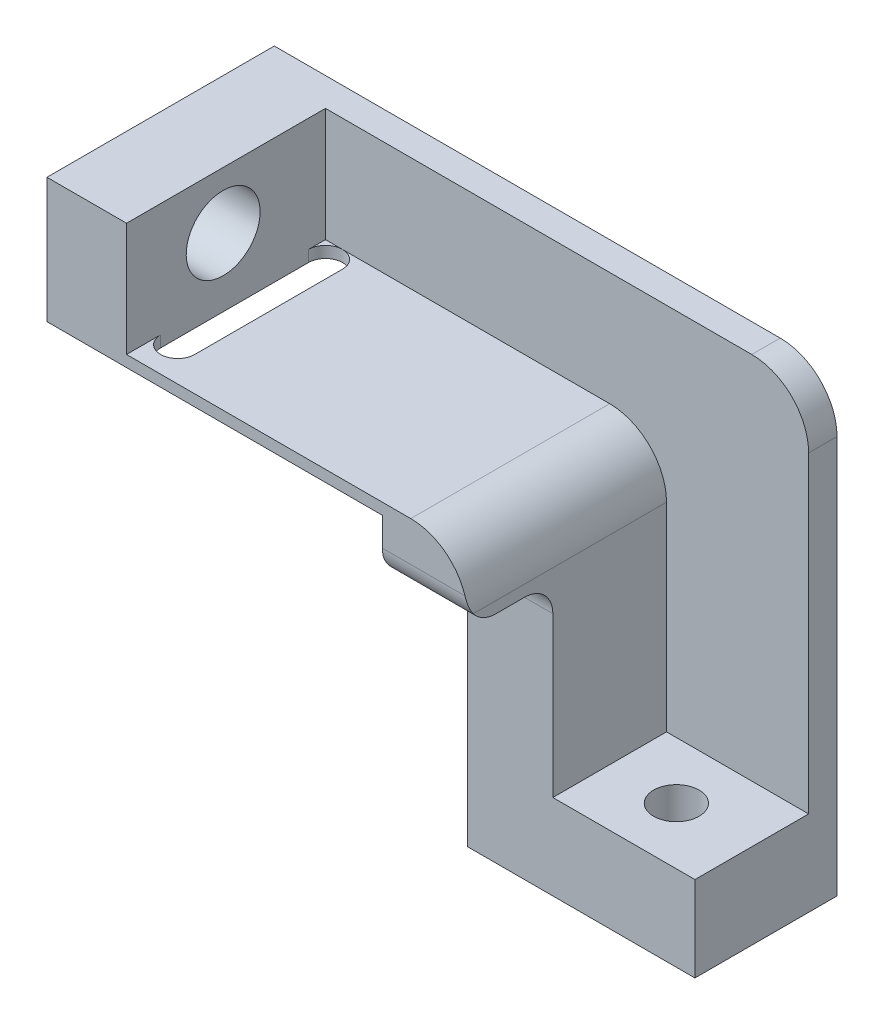
ISO-10303-21;
HEADER;
FILE_DESCRIPTION(('STEP AP214'),'2;1');
FILE_NAME('part.step','',(''),(''),'','','');
FILE_SCHEMA(('AUTOMOTIVE_DESIGN { 1 0 10303 214 1 1 1 1 }'));
ENDSEC;
DATA;
#1=APPLICATION_CONTEXT('core data for automotive mechanical design processes');
#2=APPLICATION_PROTOCOL_DEFINITION('international standard','automotive_design',2000,#1);
#3=PRODUCT_CONTEXT('',#1,'mechanical');
#4=PRODUCT('Part','Part','',(#3));
#5=PRODUCT_RELATED_PRODUCT_CATEGORY('part','',(#4));
#6=PRODUCT_DEFINITION_FORMATION('','',#4);
#7=PRODUCT_DEFINITION_CONTEXT('part definition',#1,'design');
#8=PRODUCT_DEFINITION('design','',#6,#7);
#9=PRODUCT_DEFINITION_SHAPE('','',#8);
#10=(LENGTH_UNIT() NAMED_UNIT(*) SI_UNIT(.MILLI.,.METRE.));
#11=(NAMED_UNIT(*) PLANE_ANGLE_UNIT() SI_UNIT($,.RADIAN.));
#12=(NAMED_UNIT(*) SI_UNIT($,.STERADIAN.) SOLID_ANGLE_UNIT());
#13=UNCERTAINTY_MEASURE_WITH_UNIT(LENGTH_MEASURE(1.E-05),#10,'distance_accuracy_value','');
#14=(GEOMETRIC_REPRESENTATION_CONTEXT(3) GLOBAL_UNCERTAINTY_ASSIGNED_CONTEXT((#13)) GLOBAL_UNIT_ASSIGNED_CONTEXT((#10,
#11,#12)) REPRESENTATION_CONTEXT('',''));
#15=CARTESIAN_POINT('',(0.,0.,0.));
#16=DIRECTION('',(0.,0.,1.));
#17=DIRECTION('',(1.,0.,0.));
#18=AXIS2_PLACEMENT_3D('',#15,#16,#17);
#19=CARTESIAN_POINT('',(15.,-8.32542828594916,40.));
#20=DIRECTION('',(0.,-1.,0.));
#21=DIRECTION('',(0.,0.,-1.));
#22=AXIS2_PLACEMENT_3D('',#19,#20,#21);
#23=PLANE('',#22);
#24=CARTESIAN_POINT('',(26.7301502835799,-8.32542828594916,15.));
#25=DIRECTION('',(0.,1.,0.));
#26=DIRECTION('',(0.,0.,1.));
#27=AXIS2_PLACEMENT_3D('',#24,#25,#26);
#28=CIRCLE('',#27,4.);
#29=CARTESIAN_POINT('',(26.7301502835799,-8.32542828594916,19.));
#30=VERTEX_POINT('',#29);
#31=EDGE_CURVE('E243',#30,#30,#28,.T.);
#32=ORIENTED_EDGE('',*,*,#31,.F.);
#33=EDGE_LOOP('',(#32));
#34=FACE_BOUND('',#33,.T.);
#35=DIRECTION('',(-1.,0.,0.));
#36=VECTOR('',#35,1.);
#37=CARTESIAN_POINT('',(15.,-8.32542828594916,25.));
#38=LINE('',#37,#36);
#39=CARTESIAN_POINT('',(40.,-8.32542828594916,25.));
#40=VERTEX_POINT('',#39);
#41=CARTESIAN_POINT('',(15.,-8.32542828594916,25.));
#42=VERTEX_POINT('',#41);
#43=EDGE_CURVE('E416',#40,#42,#38,.T.);
#44=ORIENTED_EDGE('',*,*,#43,.F.);
#45=DIRECTION('',(0.,0.,-1.));
#46=VECTOR('',#45,1.);
#47=CARTESIAN_POINT('',(40.,-8.32542828594916,40.));
#48=LINE('',#47,#46);
#49=CARTESIAN_POINT('',(40.,-8.32542828594915,4.99999999999999));
#50=VERTEX_POINT('',#49);
#51=EDGE_CURVE('E234',#40,#50,#48,.T.);
#52=ORIENTED_EDGE('',*,*,#51,.T.);
#53=DIRECTION('',(-1.,0.,0.));
#54=VECTOR('',#53,1.);
#55=CARTESIAN_POINT('',(40.,-8.32542828594915,4.99999999999999));
#56=LINE('',#55,#54);
#57=CARTESIAN_POINT('',(15.,-8.32542828594915,4.99999999999999));
#58=VERTEX_POINT('',#57);
#59=EDGE_CURVE('E466',#50,#58,#56,.T.);
#60=ORIENTED_EDGE('',*,*,#59,.T.);
#61=DIRECTION('',(0.,0.,-1.));
#62=VECTOR('',#61,1.);
#63=CARTESIAN_POINT('',(15.,-8.32542828594916,40.));
#64=LINE('',#63,#62);
#65=EDGE_CURVE('E231',#42,#58,#64,.T.);
#66=ORIENTED_EDGE('',*,*,#65,.F.);
#67=EDGE_LOOP('',(#44,#52,#60,#66));
#68=FACE_BOUND('',#67,.T.);
#69=ADVANCED_FACE('F39',(#34,#68),#23,.F.);
#70=CARTESIAN_POINT('',(40.,-8.32542828594916,40.));
#71=DIRECTION('',(-1.,0.,0.));
#72=DIRECTION('',(0.,-1.,0.));
#73=AXIS2_PLACEMENT_3D('',#70,#71,#72);
#74=PLANE('',#73);
#75=DIRECTION('',(0.,1.,0.));
#76=VECTOR('',#75,1.);
#77=CARTESIAN_POINT('',(40.,-23.3254282859492,25.));
#78=LINE('',#77,#76);
#79=CARTESIAN_POINT('',(40.,-23.3254282859492,25.));
#80=VERTEX_POINT('',#79);
#81=EDGE_CURVE('E196',#80,#40,#78,.T.);
#82=ORIENTED_EDGE('',*,*,#81,.F.);
#83=DIRECTION('',(0.,0.,-1.));
#84=VECTOR('',#83,1.);
#85=CARTESIAN_POINT('',(40.,-23.3254282859492,40.));
#86=LINE('',#85,#84);
#87=CARTESIAN_POINT('',(40.,-23.3254282859492,0.));
#88=VERTEX_POINT('',#87);
#89=EDGE_CURVE('E204',#80,#88,#86,.T.);
#90=ORIENTED_EDGE('',*,*,#89,.T.);
#91=DIRECTION('',(0.,1.,0.));
#92=VECTOR('',#91,1.);
#93=CARTESIAN_POINT('',(40.,-8.32542828594916,0.));
#94=LINE('',#93,#92);
#95=CARTESIAN_POINT('',(40.,46.6745717140508,0.));
#96=VERTEX_POINT('',#95);
#97=EDGE_CURVE('E242',#88,#96,#94,.T.);
#98=ORIENTED_EDGE('',*,*,#97,.T.);
#99=DIRECTION('',(0.,0.,1.));
#100=VECTOR('',#99,1.);
#101=CARTESIAN_POINT('',(40.,46.6745717140508,40.));
#102=LINE('',#101,#100);
#103=CARTESIAN_POINT('',(40.,46.6745717140508,5.));
#104=VERTEX_POINT('',#103);
#105=EDGE_CURVE('E267',#96,#104,#102,.T.);
#106=ORIENTED_EDGE('',*,*,#105,.T.);
#107=DIRECTION('',(0.,-1.,0.));
#108=VECTOR('',#107,1.);
#109=CARTESIAN_POINT('',(40.,56.6745717140508,5.));
#110=LINE('',#109,#108);
#111=EDGE_CURVE('E462',#104,#50,#110,.T.);
#112=ORIENTED_EDGE('',*,*,#111,.T.);
#113=ORIENTED_EDGE('',*,*,#51,.F.);
#114=EDGE_LOOP('',(#82,#90,#98,#106,#112,#113));
#115=FACE_BOUND('',#114,.T.);
#116=ADVANCED_FACE('F318',(#115),#74,.F.);
#117=CARTESIAN_POINT('',(40.,-23.3254282859492,40.));
#118=DIRECTION('',(0.,1.,0.));
#119=DIRECTION('',(-1.,0.,0.));
#120=AXIS2_PLACEMENT_3D('',#117,#118,#119);
#121=PLANE('',#120);
#122=CARTESIAN_POINT('',(26.7301502835799,-23.3254282859492,15.));
#123=DIRECTION('',(0.,1.,0.));
#124=DIRECTION('',(-1.,0.,0.));
#125=AXIS2_PLACEMENT_3D('',#122,#123,#124);
#126=CIRCLE('',#125,4.);
#127=CARTESIAN_POINT('',(22.7301502835799,-23.3254282859492,15.));
#128=VERTEX_POINT('',#127);
#129=EDGE_CURVE('E238',#128,#128,#126,.T.);
#130=ORIENTED_EDGE('',*,*,#129,.T.);
#131=EDGE_LOOP('',(#130));
#132=FACE_BOUND('',#131,.T.);
#133=DIRECTION('',(1.,0.,0.));
#134=VECTOR('',#133,1.);
#135=CARTESIAN_POINT('',(40.,-23.3254282859492,25.));
#136=LINE('',#135,#134);
#137=CARTESIAN_POINT('',(0.,-23.3254282859492,25.));
#138=VERTEX_POINT('',#137);
#139=EDGE_CURVE('E190',#138,#80,#136,.T.);
#140=ORIENTED_EDGE('',*,*,#139,.F.);
#141=DIRECTION('',(0.,0.,-1.));
#142=VECTOR('',#141,1.);
#143=CARTESIAN_POINT('',(0.,-23.3254282859492,40.));
#144=LINE('',#143,#142);
#145=CARTESIAN_POINT('',(0.,-23.3254282859492,0.));
#146=VERTEX_POINT('',#145);
#147=EDGE_CURVE('E202',#138,#146,#144,.T.);
#148=ORIENTED_EDGE('',*,*,#147,.T.);
#149=DIRECTION('',(1.,0.,0.));
#150=VECTOR('',#149,1.);
#151=CARTESIAN_POINT('',(40.,-23.3254282859492,0.));
#152=LINE('',#151,#150);
#153=EDGE_CURVE('E508',#146,#88,#152,.T.);
#154=ORIENTED_EDGE('',*,*,#153,.T.);
#155=ORIENTED_EDGE('',*,*,#89,.F.);
#156=EDGE_LOOP('',(#140,#148,#154,#155));
#157=FACE_BOUND('',#156,.T.);
#158=ADVANCED_FACE('F200',(#132,#157),#121,.F.);
#159=CARTESIAN_POINT('',(-45.,36.6745717140508,40.));
#160=DIRECTION('',(0.,-1.,0.));
#161=DIRECTION('',(1.,0.,0.));
#162=AXIS2_PLACEMENT_3D('',#159,#160,#161);
#163=PLANE('',#162);
#164=DIRECTION('',(0.,0.,-1.));
#165=VECTOR('',#164,1.);
#166=CARTESIAN_POINT('',(-45.,36.6745717140508,40.));
#167=LINE('',#166,#165);
#168=CARTESIAN_POINT('',(-45.,36.6745717140508,8.));
#169=VERTEX_POINT('',#168);
#170=CARTESIAN_POINT('',(-45.,36.6745717140508,5.));
#171=VERTEX_POINT('',#170);
#172=EDGE_CURVE('E477',#169,#171,#167,.T.);
#173=ORIENTED_EDGE('',*,*,#172,.F.);
#174=CARTESIAN_POINT('',(-42.,36.6745717140508,8.));
#175=DIRECTION('',(0.,-1.,0.));
#176=DIRECTION('',(1.,0.,0.));
#177=AXIS2_PLACEMENT_3D('',#174,#175,#176);
#178=CIRCLE('',#177,2.99999999999998);
#179=CARTESIAN_POINT('',(-42.,36.6745717140508,5.00000000000002));
#180=VERTEX_POINT('',#179);
#181=EDGE_CURVE('E237',#169,#180,#178,.T.);
#182=ORIENTED_EDGE('',*,*,#181,.T.);
#183=DIRECTION('',(1.,0.,0.));
#184=VECTOR('',#183,1.);
#185=CARTESIAN_POINT('',(-45.,36.6745717140508,5.));
#186=LINE('',#185,#184);
#187=EDGE_CURVE('E493',#171,#180,#186,.T.);
#188=ORIENTED_EDGE('',*,*,#187,.F.);
#189=EDGE_LOOP('',(#173,#182,#188));
#190=FACE_BOUND('',#189,.T.);
#191=ADVANCED_FACE('F332',(#190),#163,.F.);
#192=CARTESIAN_POINT('',(15.,56.6745717140508,40.));
#193=DIRECTION('',(-1.,0.,0.));
#194=DIRECTION('',(0.,-1.,0.));
#195=AXIS2_PLACEMENT_3D('',#192,#193,#194);
#196=PLANE('',#195);
#197=DIRECTION('',(0.,0.,-1.));
#198=VECTOR('',#197,1.);
#199=CARTESIAN_POINT('',(15.,26.6745717140508,40.));
#200=LINE('',#199,#198);
#201=CARTESIAN_POINT('',(15.,26.6745717140508,4.99999999999999));
#202=VERTEX_POINT('',#201);
#203=CARTESIAN_POINT('',(15.,26.6745717140508,39.));
#204=VERTEX_POINT('',#203);
#205=EDGE_CURVE('E260',#202,#204,#200,.F.);
#206=ORIENTED_EDGE('',*,*,#205,.T.);
#207=CARTESIAN_POINT('',(15.,29.6745717140508,35.));
#208=DIRECTION('',(-1.,0.,0.));
#209=DIRECTION('',(0.,-1.,0.));
#210=AXIS2_PLACEMENT_3D('',#207,#208,#209);
#211=CIRCLE('',#210,5.);
#212=CARTESIAN_POINT('',(15.,24.6745717140508,35.));
#213=VERTEX_POINT('',#212);
#214=EDGE_CURVE('E295',#204,#213,#211,.F.);
#215=ORIENTED_EDGE('',*,*,#214,.T.);
#216=DIRECTION('',(0.,0.,-1.));
#217=VECTOR('',#216,1.);
#218=CARTESIAN_POINT('',(15.,24.6745717140508,40.));
#219=LINE('',#218,#217);
#220=CARTESIAN_POINT('',(15.,24.6745717140508,30.));
#221=VERTEX_POINT('',#220);
#222=EDGE_CURVE('E393',#213,#221,#219,.T.);
#223=ORIENTED_EDGE('',*,*,#222,.T.);
#224=CARTESIAN_POINT('',(15.,19.6745717140508,30.));
#225=DIRECTION('',(-1.,0.,0.));
#226=DIRECTION('',(0.,-1.,0.));
#227=AXIS2_PLACEMENT_3D('',#224,#225,#226);
#228=CIRCLE('',#227,5.);
#229=CARTESIAN_POINT('',(15.,19.6745717140508,25.));
#230=VERTEX_POINT('',#229);
#231=EDGE_CURVE('E11',#221,#230,#228,.T.);
#232=ORIENTED_EDGE('',*,*,#231,.T.);
#233=DIRECTION('',(0.,1.,0.));
#234=VECTOR('',#233,1.);
#235=CARTESIAN_POINT('',(15.,56.6745717140508,25.));
#236=LINE('',#235,#234);
#237=EDGE_CURVE('E397',#42,#230,#236,.T.);
#238=ORIENTED_EDGE('',*,*,#237,.F.);
#239=ORIENTED_EDGE('',*,*,#65,.T.);
#240=DIRECTION('',(0.,-1.,0.));
#241=VECTOR('',#240,1.);
#242=CARTESIAN_POINT('',(15.,56.6745717140508,5.));
#243=LINE('',#242,#241);
#244=EDGE_CURVE('E461',#202,#58,#243,.T.);
#245=ORIENTED_EDGE('',*,*,#244,.F.);
#246=EDGE_LOOP('',(#206,#215,#223,#232,#238,#239,#245));
#247=FACE_BOUND('',#246,.T.);
#248=ADVANCED_FACE('F328',(#247),#196,.F.);
#249=CARTESIAN_POINT('',(-159.,46.6745717140508,23.));
#250=DIRECTION('',(1.,0.,0.));
#251=DIRECTION('',(0.,0.,-1.));
#252=AXIS2_PLACEMENT_3D('',#249,#250,#251);
#253=CYLINDRICAL_SURFACE('',#252,6.5);
#254=CARTESIAN_POINT('',(-59.,46.6745717140508,23.));
#255=DIRECTION('',(1.,0.,0.));
#256=DIRECTION('',(0.,1.,0.));
#257=AXIS2_PLACEMENT_3D('',#254,#255,#256);
#258=CIRCLE('',#257,6.5);
#259=CARTESIAN_POINT('',(-59.,53.1745717140508,23.));
#260=VERTEX_POINT('',#259);
#261=EDGE_CURVE('E244',#260,#260,#258,.T.);
#262=ORIENTED_EDGE('',*,*,#261,.F.);
#263=EDGE_LOOP('',(#262));
#264=FACE_BOUND('',#263,.T.);
#265=CARTESIAN_POINT('',(-45.,46.6745717140508,23.));
#266=DIRECTION('',(1.,0.,0.));
#267=DIRECTION('',(0.,1.,0.));
#268=AXIS2_PLACEMENT_3D('',#265,#266,#267);
#269=CIRCLE('',#268,6.5);
#270=CARTESIAN_POINT('',(-45.,53.1745717140508,23.));
#271=VERTEX_POINT('',#270);
#272=EDGE_CURVE('E248',#271,#271,#269,.F.);
#273=ORIENTED_EDGE('',*,*,#272,.F.);
#274=EDGE_LOOP('',(#273));
#275=FACE_BOUND('',#274,.T.);
#276=ADVANCED_FACE('F331',(#264,#275),#253,.F.);
#277=CARTESIAN_POINT('',(15.,56.6745717140508,40.));
#278=DIRECTION('',(0.,-1.,0.));
#279=DIRECTION('',(1.,0.,0.));
#280=AXIS2_PLACEMENT_3D('',#277,#278,#279);
#281=PLANE('',#280);
#282=DIRECTION('',(1.,0.,0.));
#283=VECTOR('',#282,1.);
#284=CARTESIAN_POINT('',(-45.,56.6745717140508,5.));
#285=LINE('',#284,#283);
#286=CARTESIAN_POINT('',(-45.,56.6745717140508,5.));
#287=VERTEX_POINT('',#286);
#288=CARTESIAN_POINT('',(30.,56.6745717140508,5.));
#289=VERTEX_POINT('',#288);
#290=EDGE_CURVE('E252',#287,#289,#285,.T.);
#291=ORIENTED_EDGE('',*,*,#290,.T.);
#292=DIRECTION('',(0.,0.,1.));
#293=VECTOR('',#292,1.);
#294=CARTESIAN_POINT('',(30.,56.6745717140508,40.));
#295=LINE('',#294,#293);
#296=CARTESIAN_POINT('',(30.,56.6745717140508,0.));
#297=VERTEX_POINT('',#296);
#298=EDGE_CURVE('E274',#289,#297,#295,.F.);
#299=ORIENTED_EDGE('',*,*,#298,.T.);
#300=DIRECTION('',(-1.,0.,0.));
#301=VECTOR('',#300,1.);
#302=CARTESIAN_POINT('',(15.,56.6745717140508,0.));
#303=LINE('',#302,#301);
#304=CARTESIAN_POINT('',(-59.,56.6745717140508,0.));
#305=VERTEX_POINT('',#304);
#306=EDGE_CURVE('E520',#297,#305,#303,.T.);
#307=ORIENTED_EDGE('',*,*,#306,.T.);
#308=DIRECTION('',(0.,0.,-1.));
#309=VECTOR('',#308,1.);
#310=CARTESIAN_POINT('',(-59.,56.6745717140508,40.));
#311=LINE('',#310,#309);
#312=CARTESIAN_POINT('',(-59.,56.6745717140508,40.));
#313=VERTEX_POINT('',#312);
#314=EDGE_CURVE('E227',#313,#305,#311,.T.);
#315=ORIENTED_EDGE('',*,*,#314,.F.);
#316=DIRECTION('',(-1.,0.,0.));
#317=VECTOR('',#316,1.);
#318=CARTESIAN_POINT('',(15.,56.6745717140508,40.));
#319=LINE('',#318,#317);
#320=CARTESIAN_POINT('',(-45.,56.6745717140508,40.));
#321=VERTEX_POINT('',#320);
#322=EDGE_CURVE('E504',#321,#313,#319,.T.);
#323=ORIENTED_EDGE('',*,*,#322,.F.);
#324=DIRECTION('',(0.,0.,1.));
#325=VECTOR('',#324,1.);
#326=CARTESIAN_POINT('',(-45.,56.6745717140508,40.));
#327=LINE('',#326,#325);
#328=EDGE_CURVE('E486',#287,#321,#327,.T.);
#329=ORIENTED_EDGE('',*,*,#328,.F.);
#330=EDGE_LOOP('',(#291,#299,#307,#315,#323,#329));
#331=FACE_BOUND('',#330,.T.);
#332=ADVANCED_FACE('F334',(#331),#281,.F.);
#333=CARTESIAN_POINT('',(-59.,56.6745717140508,40.));
#334=DIRECTION('',(1.,0.,0.));
#335=DIRECTION('',(0.,1.,0.));
#336=AXIS2_PLACEMENT_3D('',#333,#334,#335);
#337=PLANE('',#336);
#338=ORIENTED_EDGE('',*,*,#261,.T.);
#339=EDGE_LOOP('',(#338));
#340=FACE_BOUND('',#339,.T.);
#341=DIRECTION('',(0.,-1.,0.));
#342=VECTOR('',#341,1.);
#343=CARTESIAN_POINT('',(-59.,56.6745717140508,0.));
#344=LINE('',#343,#342);
#345=CARTESIAN_POINT('',(-59.,34.6745717140508,0.));
#346=VERTEX_POINT('',#345);
#347=EDGE_CURVE('E523',#305,#346,#344,.T.);
#348=ORIENTED_EDGE('',*,*,#347,.T.);
#349=DIRECTION('',(0.,0.,-1.));
#350=VECTOR('',#349,1.);
#351=CARTESIAN_POINT('',(-59.,34.6745717140508,40.));
#352=LINE('',#351,#350);
#353=CARTESIAN_POINT('',(-59.,34.6745717140508,40.));
#354=VERTEX_POINT('',#353);
#355=EDGE_CURVE('E218',#354,#346,#352,.T.);
#356=ORIENTED_EDGE('',*,*,#355,.F.);
#357=DIRECTION('',(0.,-1.,0.));
#358=VECTOR('',#357,1.);
#359=CARTESIAN_POINT('',(-59.,56.6745717140508,40.));
#360=LINE('',#359,#358);
#361=EDGE_CURVE('E507',#313,#354,#360,.T.);
#362=ORIENTED_EDGE('',*,*,#361,.F.);
#363=ORIENTED_EDGE('',*,*,#314,.T.);
#364=EDGE_LOOP('',(#348,#356,#362,#363));
#365=FACE_BOUND('',#364,.T.);
#366=ADVANCED_FACE('F337',(#340,#365),#337,.F.);
#367=CARTESIAN_POINT('',(-59.,34.6745717140508,40.));
#368=DIRECTION('',(0.,1.,0.));
#369=DIRECTION('',(0.,0.,1.));
#370=AXIS2_PLACEMENT_3D('',#367,#368,#369);
#371=PLANE('',#370);
#372=DIRECTION('',(0.,0.,-1.));
#373=VECTOR('',#372,1.);
#374=CARTESIAN_POINT('',(-39.,34.6745717140508,40.));
#375=LINE('',#374,#373);
#376=CARTESIAN_POINT('',(-39.,34.6745717140508,34.));
#377=VERTEX_POINT('',#376);
#378=CARTESIAN_POINT('',(-39.,34.6745717140508,8.));
#379=VERTEX_POINT('',#378);
#380=EDGE_CURVE('E453',#377,#379,#375,.T.);
#381=ORIENTED_EDGE('',*,*,#380,.T.);
#382=CARTESIAN_POINT('',(-42.,34.6745717140508,8.));
#383=DIRECTION('',(0.,1.,0.));
#384=DIRECTION('',(0.,0.,1.));
#385=AXIS2_PLACEMENT_3D('',#382,#383,#384);
#386=CIRCLE('',#385,2.99999999999998);
#387=CARTESIAN_POINT('',(-45.,34.6745717140508,8.));
#388=VERTEX_POINT('',#387);
#389=EDGE_CURVE('E457',#379,#388,#386,.T.);
#390=ORIENTED_EDGE('',*,*,#389,.T.);
#391=DIRECTION('',(0.,0.,1.));
#392=VECTOR('',#391,1.);
#393=CARTESIAN_POINT('',(-45.,34.6745717140508,40.));
#394=LINE('',#393,#392);
#395=CARTESIAN_POINT('',(-45.,34.6745717140508,34.));
#396=VERTEX_POINT('',#395);
#397=EDGE_CURVE('E437',#388,#396,#394,.T.);
#398=ORIENTED_EDGE('',*,*,#397,.T.);
#399=CARTESIAN_POINT('',(-42.,34.6745717140508,34.));
#400=DIRECTION('',(0.,1.,0.));
#401=DIRECTION('',(0.,0.,1.));
#402=AXIS2_PLACEMENT_3D('',#399,#400,#401);
#403=CIRCLE('',#402,2.99999999999999);
#404=EDGE_CURVE('E449',#396,#377,#403,.T.);
#405=ORIENTED_EDGE('',*,*,#404,.T.);
#406=EDGE_LOOP('',(#381,#390,#398,#405));
#407=FACE_BOUND('',#406,.T.);
#408=DIRECTION('',(1.,0.,0.));
#409=VECTOR('',#408,1.);
#410=CARTESIAN_POINT('',(-59.,34.6745717140508,0.));
#411=LINE('',#410,#409);
#412=CARTESIAN_POINT('',(0.,34.6745717140508,0.));
#413=VERTEX_POINT('',#412);
#414=EDGE_CURVE('E526',#346,#413,#411,.T.);
#415=ORIENTED_EDGE('',*,*,#414,.T.);
#416=DIRECTION('',(0.,0.,-1.));
#417=VECTOR('',#416,1.);
#418=CARTESIAN_POINT('',(0.,34.6745717140508,40.));
#419=LINE('',#418,#417);
#420=CARTESIAN_POINT('',(0.,34.6745717140508,40.));
#421=VERTEX_POINT('',#420);
#422=EDGE_CURVE('E214',#421,#413,#419,.T.);
#423=ORIENTED_EDGE('',*,*,#422,.F.);
#424=DIRECTION('',(1.,0.,0.));
#425=VECTOR('',#424,1.);
#426=CARTESIAN_POINT('',(-59.,34.6745717140508,40.));
#427=LINE('',#426,#425);
#428=EDGE_CURVE('E511',#354,#421,#427,.T.);
#429=ORIENTED_EDGE('',*,*,#428,.F.);
#430=ORIENTED_EDGE('',*,*,#355,.T.);
#431=EDGE_LOOP('',(#415,#423,#429,#430));
#432=FACE_BOUND('',#431,.T.);
#433=ADVANCED_FACE('F341',(#407,#432),#371,.F.);
#434=CARTESIAN_POINT('',(0.,-23.3254282859492,40.));
#435=DIRECTION('',(1.,0.,0.));
#436=DIRECTION('',(0.,0.,-1.));
#437=AXIS2_PLACEMENT_3D('',#434,#435,#436);
#438=PLANE('',#437);
#439=DIRECTION('',(0.,0.,1.));
#440=VECTOR('',#439,1.);
#441=CARTESIAN_POINT('',(0.,24.6745717140508,25.));
#442=LINE('',#441,#440);
#443=CARTESIAN_POINT('',(0.,24.6745717140508,30.));
#444=VERTEX_POINT('',#443);
#445=CARTESIAN_POINT('',(0.,24.6745717140508,35.));
#446=VERTEX_POINT('',#445);
#447=EDGE_CURVE('E206',#444,#446,#442,.T.);
#448=ORIENTED_EDGE('',*,*,#447,.T.);
#449=CARTESIAN_POINT('',(0.,29.6745717140508,35.));
#450=DIRECTION('',(1.,0.,0.));
#451=DIRECTION('',(0.,0.,-1.));
#452=AXIS2_PLACEMENT_3D('',#449,#450,#451);
#453=CIRCLE('',#452,5.);
#454=CARTESIAN_POINT('',(0.,29.6745717140508,40.));
#455=VERTEX_POINT('',#454);
#456=EDGE_CURVE('E402',#446,#455,#453,.F.);
#457=ORIENTED_EDGE('',*,*,#456,.T.);
#458=DIRECTION('',(0.,-1.,0.));
#459=VECTOR('',#458,1.);
#460=CARTESIAN_POINT('',(0.,-23.3254282859492,40.));
#461=LINE('',#460,#459);
#462=EDGE_CURVE('E220',#421,#455,#461,.T.);
#463=ORIENTED_EDGE('',*,*,#462,.F.);
#464=ORIENTED_EDGE('',*,*,#422,.T.);
#465=DIRECTION('',(0.,-1.,0.));
#466=VECTOR('',#465,1.);
#467=CARTESIAN_POINT('',(0.,-23.3254282859492,0.));
#468=LINE('',#467,#466);
#469=EDGE_CURVE('E211',#413,#146,#468,.T.);
#470=ORIENTED_EDGE('',*,*,#469,.T.);
#471=ORIENTED_EDGE('',*,*,#147,.F.);
#472=DIRECTION('',(0.,-1.,0.));
#473=VECTOR('',#472,1.);
#474=CARTESIAN_POINT('',(0.,-23.3254282859492,25.));
#475=LINE('',#474,#473);
#476=CARTESIAN_POINT('',(0.,19.6745717140508,25.));
#477=VERTEX_POINT('',#476);
#478=EDGE_CURVE('E186',#477,#138,#475,.T.);
#479=ORIENTED_EDGE('',*,*,#478,.F.);
#480=CARTESIAN_POINT('',(0.,19.6745717140508,30.));
#481=DIRECTION('',(1.,0.,0.));
#482=DIRECTION('',(0.,0.,-1.));
#483=AXIS2_PLACEMENT_3D('',#480,#481,#482);
#484=CIRCLE('',#483,5.);
#485=EDGE_CURVE('E48',#477,#444,#484,.T.);
#486=ORIENTED_EDGE('',*,*,#485,.T.);
#487=EDGE_LOOP('',(#448,#457,#463,#464,#470,#471,#479,#486));
#488=FACE_BOUND('',#487,.T.);
#489=ADVANCED_FACE('F208',(#488),#438,.F.);
#490=CARTESIAN_POINT('',(0.,0.,40.));
#491=DIRECTION('',(0.,0.,-1.));
#492=DIRECTION('',(-1.,0.,0.));
#493=AXIS2_PLACEMENT_3D('',#490,#491,#492);
#494=PLANE('',#493);
#495=ORIENTED_EDGE('',*,*,#462,.T.);
#496=DIRECTION('',(1.,0.,0.));
#497=VECTOR('',#496,1.);
#498=CARTESIAN_POINT('',(0.,29.6745717140508,40.));
#499=LINE('',#498,#497);
#500=CARTESIAN_POINT('',(14.5393920141695,29.6745717140508,40.));
#501=VERTEX_POINT('',#500);
#502=EDGE_CURVE('E283',#455,#501,#499,.T.);
#503=ORIENTED_EDGE('',*,*,#502,.T.);
#504=CARTESIAN_POINT('',(5.,26.6745717140508,40.));
#505=DIRECTION('',(0.,0.,-1.));
#506=DIRECTION('',(-1.,0.,0.));
#507=AXIS2_PLACEMENT_3D('',#504,#505,#506);
#508=CIRCLE('',#507,10.);
#509=CARTESIAN_POINT('',(5.,36.6745717140508,40.));
#510=VERTEX_POINT('',#509);
#511=EDGE_CURVE('E264',#501,#510,#508,.F.);
#512=ORIENTED_EDGE('',*,*,#511,.T.);
#513=DIRECTION('',(1.,0.,0.));
#514=VECTOR('',#513,1.);
#515=CARTESIAN_POINT('',(-45.,36.6745717140508,40.));
#516=LINE('',#515,#514);
#517=CARTESIAN_POINT('',(-45.,36.6745717140508,40.));
#518=VERTEX_POINT('',#517);
#519=EDGE_CURVE('E489',#518,#510,#516,.T.);
#520=ORIENTED_EDGE('',*,*,#519,.F.);
#521=DIRECTION('',(0.,-1.,0.));
#522=VECTOR('',#521,1.);
#523=CARTESIAN_POINT('',(-45.,56.6745717140508,40.));
#524=LINE('',#523,#522);
#525=EDGE_CURVE('E473',#321,#518,#524,.T.);
#526=ORIENTED_EDGE('',*,*,#525,.F.);
#527=ORIENTED_EDGE('',*,*,#322,.T.);
#528=ORIENTED_EDGE('',*,*,#361,.T.);
#529=ORIENTED_EDGE('',*,*,#428,.T.);
#530=EDGE_LOOP('',(#495,#503,#512,#520,#526,#527,#528,#529));
#531=FACE_BOUND('',#530,.T.);
#532=ADVANCED_FACE('F348',(#531),#494,.F.);
#533=CARTESIAN_POINT('',(0.,0.,0.));
#534=DIRECTION('',(0.,0.,-1.));
#535=DIRECTION('',(-1.,0.,0.));
#536=AXIS2_PLACEMENT_3D('',#533,#534,#535);
#537=PLANE('',#536);
#538=ORIENTED_EDGE('',*,*,#306,.F.);
#539=CARTESIAN_POINT('',(30.,46.6745717140508,0.));
#540=DIRECTION('',(0.,0.,-1.));
#541=DIRECTION('',(-1.,0.,0.));
#542=AXIS2_PLACEMENT_3D('',#539,#540,#541);
#543=CIRCLE('',#542,10.);
#544=EDGE_CURVE('E277',#297,#96,#543,.T.);
#545=ORIENTED_EDGE('',*,*,#544,.T.);
#546=ORIENTED_EDGE('',*,*,#97,.F.);
#547=ORIENTED_EDGE('',*,*,#153,.F.);
#548=ORIENTED_EDGE('',*,*,#469,.F.);
#549=ORIENTED_EDGE('',*,*,#414,.F.);
#550=ORIENTED_EDGE('',*,*,#347,.F.);
#551=EDGE_LOOP('',(#538,#545,#546,#547,#548,#549,#550));
#552=FACE_BOUND('',#551,.T.);
#553=ADVANCED_FACE('F352',(#552),#537,.T.);
#554=CARTESIAN_POINT('',(26.7301502835799,-38.3254282859492,15.));
#555=DIRECTION('',(0.,1.,0.));
#556=DIRECTION('',(0.,0.,1.));
#557=AXIS2_PLACEMENT_3D('',#554,#555,#556);
#558=CYLINDRICAL_SURFACE('',#557,4.);
#559=ORIENTED_EDGE('',*,*,#31,.T.);
#560=EDGE_LOOP('',(#559));
#561=FACE_BOUND('',#560,.T.);
#562=ORIENTED_EDGE('',*,*,#129,.F.);
#563=EDGE_LOOP('',(#562));
#564=FACE_BOUND('',#563,.T.);
#565=ADVANCED_FACE('F355',(#561,#564),#558,.F.);
#566=CARTESIAN_POINT('',(-45.,0.,0.));
#567=DIRECTION('',(1.,0.,0.));
#568=DIRECTION('',(0.,1.,0.));
#569=AXIS2_PLACEMENT_3D('',#566,#567,#568);
#570=PLANE('',#569);
#571=ORIENTED_EDGE('',*,*,#525,.T.);
#572=CARTESIAN_POINT('',(-45.,36.6745717140508,34.));
#573=VERTEX_POINT('',#572);
#574=EDGE_CURVE('E478',#518,#573,#167,.T.);
#575=ORIENTED_EDGE('',*,*,#574,.T.);
#576=DIRECTION('',(0.,1.,0.));
#577=VECTOR('',#576,1.);
#578=CARTESIAN_POINT('',(-45.,26.6745717140508,34.));
#579=LINE('',#578,#577);
#580=EDGE_CURVE('E441',#396,#573,#579,.T.);
#581=ORIENTED_EDGE('',*,*,#580,.F.);
#582=ORIENTED_EDGE('',*,*,#397,.F.);
#583=DIRECTION('',(0.,1.,0.));
#584=VECTOR('',#583,1.);
#585=CARTESIAN_POINT('',(-45.,26.6745717140508,8.));
#586=LINE('',#585,#584);
#587=EDGE_CURVE('E433',#388,#169,#586,.T.);
#588=ORIENTED_EDGE('',*,*,#587,.T.);
#589=ORIENTED_EDGE('',*,*,#172,.T.);
#590=DIRECTION('',(0.,1.,0.));
#591=VECTOR('',#590,1.);
#592=CARTESIAN_POINT('',(-45.,56.6745717140508,5.));
#593=LINE('',#592,#591);
#594=EDGE_CURVE('E482',#171,#287,#593,.T.);
#595=ORIENTED_EDGE('',*,*,#594,.T.);
#596=ORIENTED_EDGE('',*,*,#328,.T.);
#597=EDGE_LOOP('',(#571,#575,#581,#582,#588,#589,#595,#596));
#598=FACE_BOUND('',#597,.T.);
#599=ORIENTED_EDGE('',*,*,#272,.T.);
#600=EDGE_LOOP('',(#599));
#601=FACE_BOUND('',#600,.T.);
#602=ADVANCED_FACE('F362',(#598,#601),#570,.T.);
#603=CARTESIAN_POINT('',(-45.,56.6745717140508,5.));
#604=DIRECTION('',(0.,0.,-1.));
#605=DIRECTION('',(0.,1.,0.));
#606=AXIS2_PLACEMENT_3D('',#603,#604,#605);
#607=PLANE('',#606);
#608=ORIENTED_EDGE('',*,*,#111,.F.);
#609=CARTESIAN_POINT('',(30.,46.6745717140508,5.));
#610=DIRECTION('',(0.,0.,-1.));
#611=DIRECTION('',(0.,1.,0.));
#612=AXIS2_PLACEMENT_3D('',#609,#610,#611);
#613=CIRCLE('',#612,10.);
#614=EDGE_CURVE('E271',#104,#289,#613,.F.);
#615=ORIENTED_EDGE('',*,*,#614,.T.);
#616=ORIENTED_EDGE('',*,*,#290,.F.);
#617=ORIENTED_EDGE('',*,*,#594,.F.);
#618=ORIENTED_EDGE('',*,*,#187,.T.);
#619=CARTESIAN_POINT('',(5.,36.6745717140508,5.));
#620=VERTEX_POINT('',#619);
#621=EDGE_CURVE('E497',#180,#620,#186,.T.);
#622=ORIENTED_EDGE('',*,*,#621,.T.);
#623=CARTESIAN_POINT('',(5.,26.6745717140508,5.));
#624=DIRECTION('',(0.,0.,-1.));
#625=DIRECTION('',(0.,1.,0.));
#626=AXIS2_PLACEMENT_3D('',#623,#624,#625);
#627=CIRCLE('',#626,10.);
#628=EDGE_CURVE('E280',#620,#202,#627,.T.);
#629=ORIENTED_EDGE('',*,*,#628,.T.);
#630=ORIENTED_EDGE('',*,*,#244,.T.);
#631=ORIENTED_EDGE('',*,*,#59,.F.);
#632=EDGE_LOOP('',(#608,#615,#616,#617,#618,#622,#629,#630,#631));
#633=FACE_BOUND('',#632,.T.);
#634=ADVANCED_FACE('F371',(#633),#607,.F.);
#635=ORIENTED_EDGE('',*,*,#519,.T.);
#636=DIRECTION('',(0.,0.,-1.));
#637=VECTOR('',#636,1.);
#638=CARTESIAN_POINT('',(5.,36.6745717140508,40.));
#639=LINE('',#638,#637);
#640=EDGE_CURVE('E256',#510,#620,#639,.T.);
#641=ORIENTED_EDGE('',*,*,#640,.T.);
#642=ORIENTED_EDGE('',*,*,#621,.F.);
#643=CARTESIAN_POINT('',(-42.,36.6745717140508,8.));
#644=DIRECTION('',(0.,1.,0.));
#645=DIRECTION('',(-1.,0.,0.));
#646=AXIS2_PLACEMENT_3D('',#643,#644,#645);
#647=CIRCLE('',#646,2.99999999999998);
#648=CARTESIAN_POINT('',(-39.,36.6745717140508,8.));
#649=VERTEX_POINT('',#648);
#650=EDGE_CURVE('E420',#649,#180,#647,.T.);
#651=ORIENTED_EDGE('',*,*,#650,.F.);
#652=DIRECTION('',(0.,0.,-1.));
#653=VECTOR('',#652,1.);
#654=CARTESIAN_POINT('',(-39.,36.6745717140508,8.));
#655=LINE('',#654,#653);
#656=CARTESIAN_POINT('',(-39.,36.6745717140508,34.));
#657=VERTEX_POINT('',#656);
#658=EDGE_CURVE('E429',#657,#649,#655,.T.);
#659=ORIENTED_EDGE('',*,*,#658,.F.);
#660=CARTESIAN_POINT('',(-42.,36.6745717140508,34.));
#661=DIRECTION('',(0.,1.,0.));
#662=DIRECTION('',(-1.,0.,0.));
#663=AXIS2_PLACEMENT_3D('',#660,#661,#662);
#664=CIRCLE('',#663,2.99999999999999);
#665=EDGE_CURVE('E425',#573,#657,#664,.T.);
#666=ORIENTED_EDGE('',*,*,#665,.F.);
#667=ORIENTED_EDGE('',*,*,#574,.F.);
#668=EDGE_LOOP('',(#635,#641,#642,#651,#659,#666,#667));
#669=FACE_BOUND('',#668,.T.);
#670=ADVANCED_FACE('F367',(#669),#163,.F.);
#671=CARTESIAN_POINT('',(-42.,26.6745717140508,8.));
#672=DIRECTION('',(0.,1.,0.));
#673=DIRECTION('',(-1.,0.,0.));
#674=AXIS2_PLACEMENT_3D('',#671,#672,#673);
#675=CYLINDRICAL_SURFACE('',#674,2.99999999999998);
#676=DIRECTION('',(0.,1.,0.));
#677=VECTOR('',#676,1.);
#678=CARTESIAN_POINT('',(-39.,26.6745717140508,8.));
#679=LINE('',#678,#677);
#680=EDGE_CURVE('E434',#379,#649,#679,.T.);
#681=ORIENTED_EDGE('',*,*,#680,.T.);
#682=ORIENTED_EDGE('',*,*,#650,.T.);
#683=ORIENTED_EDGE('',*,*,#181,.F.);
#684=ORIENTED_EDGE('',*,*,#587,.F.);
#685=ORIENTED_EDGE('',*,*,#389,.F.);
#686=EDGE_LOOP('',(#681,#682,#683,#684,#685));
#687=FACE_BOUND('',#686,.T.);
#688=ADVANCED_FACE('F370',(#687),#675,.F.);
#689=CARTESIAN_POINT('',(-39.,26.6745717140508,8.));
#690=DIRECTION('',(1.,0.,0.));
#691=DIRECTION('',(0.,0.,-1.));
#692=AXIS2_PLACEMENT_3D('',#689,#690,#691);
#693=PLANE('',#692);
#694=DIRECTION('',(0.,1.,0.));
#695=VECTOR('',#694,1.);
#696=CARTESIAN_POINT('',(-39.,26.6745717140508,34.));
#697=LINE('',#696,#695);
#698=EDGE_CURVE('E438',#377,#657,#697,.T.);
#699=ORIENTED_EDGE('',*,*,#698,.T.);
#700=ORIENTED_EDGE('',*,*,#658,.T.);
#701=ORIENTED_EDGE('',*,*,#680,.F.);
#702=ORIENTED_EDGE('',*,*,#380,.F.);
#703=EDGE_LOOP('',(#699,#700,#701,#702));
#704=FACE_BOUND('',#703,.T.);
#705=ADVANCED_FACE('F381',(#704),#693,.F.);
#706=CARTESIAN_POINT('',(-42.,26.6745717140508,34.));
#707=DIRECTION('',(0.,1.,0.));
#708=DIRECTION('',(-1.,0.,0.));
#709=AXIS2_PLACEMENT_3D('',#706,#707,#708);
#710=CYLINDRICAL_SURFACE('',#709,2.99999999999999);
#711=ORIENTED_EDGE('',*,*,#580,.T.);
#712=ORIENTED_EDGE('',*,*,#665,.T.);
#713=ORIENTED_EDGE('',*,*,#698,.F.);
#714=ORIENTED_EDGE('',*,*,#404,.F.);
#715=EDGE_LOOP('',(#711,#712,#713,#714));
#716=FACE_BOUND('',#715,.T.);
#717=ADVANCED_FACE('F314',(#716),#710,.F.);
#718=CARTESIAN_POINT('',(5.,26.6745717140508,40.));
#719=DIRECTION('',(0.,0.,-1.));
#720=DIRECTION('',(-1.,0.,0.));
#721=AXIS2_PLACEMENT_3D('',#718,#719,#720);
#722=CYLINDRICAL_SURFACE('',#721,10.);
#723=ORIENTED_EDGE('',*,*,#511,.F.);
#724=CARTESIAN_POINT('',(14.5393920141695,29.6745717140508,40.));
#725=CARTESIAN_POINT('',(14.5789214569994,29.5489527452978,40.0000206816987));
#726=CARTESIAN_POINT('',(14.6159324588455,29.422520005661,39.9952663226852));
#727=CARTESIAN_POINT('',(14.6847856638636,29.1689778472598,39.9759910290208));
#728=CARTESIAN_POINT('',(14.7166271733001,29.0418683400347,39.9614687848819));
#729=CARTESIAN_POINT('',(14.7741471717945,28.7916622233677,39.9230105119534));
#730=CARTESIAN_POINT('',(14.7999783839696,28.6685567464997,39.8993615387543));
#731=CARTESIAN_POINT('',(14.8466462174956,28.4235990741327,39.8426098705927));
#732=CARTESIAN_POINT('',(14.8674833390666,28.3017467542857,39.8095081231711));
#733=CARTESIAN_POINT('',(14.9060097921216,28.0489128786912,39.7303679002232));
#734=CARTESIAN_POINT('',(14.9232212651107,27.9181456751907,39.6834079077704));
#735=CARTESIAN_POINT('',(14.9521307518349,27.6604331553322,39.5784948460736));
#736=CARTESIAN_POINT('',(14.9638272255796,27.5334889157388,39.5205387126312));
#737=CARTESIAN_POINT('',(14.9824553608146,27.2805184407317,39.3919559196617));
#738=CARTESIAN_POINT('',(14.9892175947559,27.1546598214871,39.32097512437));
#739=CARTESIAN_POINT('',(14.9979986508314,26.9094568598642,39.1683412348538));
#740=CARTESIAN_POINT('',(15.0000186951868,26.7901108467163,39.0866908962564));
#741=CARTESIAN_POINT('',(15.,26.6745717140508,39.));
#742=B_SPLINE_CURVE_WITH_KNOTS('',3,(#724,#725,#726,#727,#728,#729,#730,#731,#732,#733,#734,
#735,#736,#737,#738,#739,#740,#741),.UNSPECIFIED.,.F.,.F.,(4,2,2,2,2,2,2,2,4),(0.,
0.394993614215275,0.790040192043578,1.17355946224634,1.55704030217004,1.97645150763839,
2.39597975886547,2.82931085687476,3.26253025867321),.UNSPECIFIED.);
#743=EDGE_CURVE('E287',#501,#204,#742,.T.);
#744=ORIENTED_EDGE('',*,*,#743,.T.);
#745=ORIENTED_EDGE('',*,*,#205,.F.);
#746=ORIENTED_EDGE('',*,*,#628,.F.);
#747=ORIENTED_EDGE('',*,*,#640,.F.);
#748=EDGE_LOOP('',(#723,#744,#745,#746,#747));
#749=FACE_BOUND('',#748,.T.);
#750=ADVANCED_FACE('F297',(#749),#722,.T.);
#751=CARTESIAN_POINT('',(30.,46.6745717140508,40.));
#752=DIRECTION('',(0.,0.,1.));
#753=DIRECTION('',(1.,0.,0.));
#754=AXIS2_PLACEMENT_3D('',#751,#752,#753);
#755=CYLINDRICAL_SURFACE('',#754,10.);
#756=ORIENTED_EDGE('',*,*,#544,.F.);
#757=ORIENTED_EDGE('',*,*,#298,.F.);
#758=ORIENTED_EDGE('',*,*,#614,.F.);
#759=ORIENTED_EDGE('',*,*,#105,.F.);
#760=EDGE_LOOP('',(#756,#757,#758,#759));
#761=FACE_BOUND('',#760,.T.);
#762=ADVANCED_FACE('F306',(#761),#755,.T.);
#763=CARTESIAN_POINT('',(0.,0.,25.));
#764=DIRECTION('',(0.,0.,1.));
#765=DIRECTION('',(1.,0.,0.));
#766=AXIS2_PLACEMENT_3D('',#763,#764,#765);
#767=PLANE('',#766);
#768=ORIENTED_EDGE('',*,*,#237,.T.);
#769=DIRECTION('',(-1.,0.,0.));
#770=VECTOR('',#769,1.);
#771=CARTESIAN_POINT('',(0.,19.6745717140508,25.));
#772=LINE('',#771,#770);
#773=EDGE_CURVE('E192',#230,#477,#772,.T.);
#774=ORIENTED_EDGE('',*,*,#773,.T.);
#775=ORIENTED_EDGE('',*,*,#478,.T.);
#776=ORIENTED_EDGE('',*,*,#139,.T.);
#777=ORIENTED_EDGE('',*,*,#81,.T.);
#778=ORIENTED_EDGE('',*,*,#43,.T.);
#779=EDGE_LOOP('',(#768,#774,#775,#776,#777,#778));
#780=FACE_BOUND('',#779,.T.);
#781=ADVANCED_FACE('F189',(#780),#767,.T.);
#782=CARTESIAN_POINT('',(40.,24.6745717140508,25.));
#783=DIRECTION('',(0.,1.,0.));
#784=DIRECTION('',(-1.,0.,0.));
#785=AXIS2_PLACEMENT_3D('',#782,#783,#784);
#786=PLANE('',#785);
#787=ORIENTED_EDGE('',*,*,#222,.F.);
#788=DIRECTION('',(1.,0.,0.));
#789=VECTOR('',#788,1.);
#790=CARTESIAN_POINT('',(40.,24.6745717140508,35.));
#791=LINE('',#790,#789);
#792=EDGE_CURVE('E62',#213,#446,#791,.F.);
#793=ORIENTED_EDGE('',*,*,#792,.T.);
#794=ORIENTED_EDGE('',*,*,#447,.F.);
#795=DIRECTION('',(-1.,0.,0.));
#796=VECTOR('',#795,1.);
#797=CARTESIAN_POINT('',(40.,24.6745717140508,30.));
#798=LINE('',#797,#796);
#799=EDGE_CURVE('E394',#444,#221,#798,.F.);
#800=ORIENTED_EDGE('',*,*,#799,.T.);
#801=EDGE_LOOP('',(#787,#793,#794,#800));
#802=FACE_BOUND('',#801,.T.);
#803=ADVANCED_FACE('F304',(#802),#786,.F.);
#804=CARTESIAN_POINT('',(0.,29.6745717140508,35.));
#805=DIRECTION('',(1.,0.,0.));
#806=DIRECTION('',(0.,1.,0.));
#807=AXIS2_PLACEMENT_3D('',#804,#805,#806);
#808=CYLINDRICAL_SURFACE('',#807,5.);
#809=ORIENTED_EDGE('',*,*,#456,.F.);
#810=ORIENTED_EDGE('',*,*,#792,.F.);
#811=ORIENTED_EDGE('',*,*,#214,.F.);
#812=ORIENTED_EDGE('',*,*,#743,.F.);
#813=ORIENTED_EDGE('',*,*,#502,.F.);
#814=EDGE_LOOP('',(#809,#810,#811,#812,#813));
#815=FACE_BOUND('',#814,.T.);
#816=ADVANCED_FACE('F301',(#815),#808,.T.);
#817=CARTESIAN_POINT('',(0.,19.6745717140508,30.));
#818=DIRECTION('',(-1.,0.,0.));
#819=DIRECTION('',(0.,-1.,0.));
#820=AXIS2_PLACEMENT_3D('',#817,#818,#819);
#821=CYLINDRICAL_SURFACE('',#820,5.);
#822=ORIENTED_EDGE('',*,*,#231,.F.);
#823=ORIENTED_EDGE('',*,*,#799,.F.);
#824=ORIENTED_EDGE('',*,*,#485,.F.);
#825=ORIENTED_EDGE('',*,*,#773,.F.);
#826=EDGE_LOOP('',(#822,#823,#824,#825));
#827=FACE_BOUND('',#826,.T.);
#828=ADVANCED_FACE('F41',(#827),#821,.F.);
#829=CLOSED_SHELL('',(#69,#116,#158,#191,#248,#276,#332,#366,#433,#489,#532,#553,#565,#602,#634,
#670,#688,#705,#717,#750,#762,#781,#803,#816,#828));
#830=MANIFOLD_SOLID_BREP('B2',#829);
#831=ADVANCED_BREP_SHAPE_REPRESENTATION('',(#18,#830),#14);
#832=SHAPE_DEFINITION_REPRESENTATION(#9,#831);
ENDSEC;
END-ISO-10303-21;
